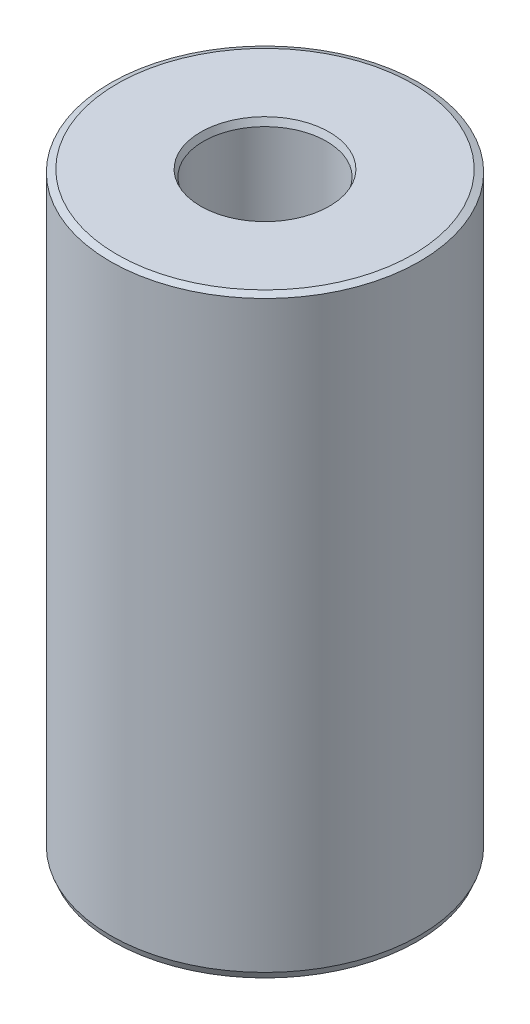
ISO-10303-21;
HEADER;
FILE_DESCRIPTION(('STEP AP214'),'2;1');
FILE_NAME('part.step','',(''),(''),'','','');
FILE_SCHEMA(('AUTOMOTIVE_DESIGN { 1 0 10303 214 1 1 1 1 }'));
ENDSEC;
DATA;
#1=APPLICATION_CONTEXT('core data for automotive mechanical design processes');
#2=APPLICATION_PROTOCOL_DEFINITION('international standard','automotive_design',2000,#1);
#3=PRODUCT_CONTEXT('',#1,'mechanical');
#4=PRODUCT('Part','Part','',(#3));
#5=PRODUCT_RELATED_PRODUCT_CATEGORY('part','',(#4));
#6=PRODUCT_DEFINITION_FORMATION('','',#4);
#7=PRODUCT_DEFINITION_CONTEXT('part definition',#1,'design');
#8=PRODUCT_DEFINITION('design','',#6,#7);
#9=PRODUCT_DEFINITION_SHAPE('','',#8);
#10=(LENGTH_UNIT() NAMED_UNIT(*) SI_UNIT(.MILLI.,.METRE.));
#11=(NAMED_UNIT(*) PLANE_ANGLE_UNIT() SI_UNIT($,.RADIAN.));
#12=(NAMED_UNIT(*) SI_UNIT($,.STERADIAN.) SOLID_ANGLE_UNIT());
#13=UNCERTAINTY_MEASURE_WITH_UNIT(LENGTH_MEASURE(1.E-05),#10,'distance_accuracy_value','');
#14=(GEOMETRIC_REPRESENTATION_CONTEXT(3) GLOBAL_UNCERTAINTY_ASSIGNED_CONTEXT((#13)) GLOBAL_UNIT_ASSIGNED_CONTEXT((#10,
#11,#12)) REPRESENTATION_CONTEXT('',''));
#15=CARTESIAN_POINT('',(0.,0.,0.));
#16=DIRECTION('',(0.,0.,1.));
#17=DIRECTION('',(1.,0.,0.));
#18=AXIS2_PLACEMENT_3D('',#15,#16,#17);
#19=CARTESIAN_POINT('',(0.,95.8740188078757,0.));
#20=DIRECTION('',(0.,-1.,0.));
#21=DIRECTION('',(0.,0.,-1.));
#22=AXIS2_PLACEMENT_3D('',#19,#20,#21);
#23=CYLINDRICAL_SURFACE('',#22,25.);
#24=CARTESIAN_POINT('',(0.,1.08448727969515,0.));
#25=DIRECTION('',(0.,1.,0.));
#26=DIRECTION('',(0.,0.,1.));
#27=AXIS2_PLACEMENT_3D('',#24,#25,#26);
#28=CIRCLE('',#27,25.);
#29=CARTESIAN_POINT('',(0.,1.08448727969515,25.));
#30=VERTEX_POINT('',#29);
#31=EDGE_CURVE('E10',#30,#30,#28,.T.);
#32=ORIENTED_EDGE('',*,*,#31,.T.);
#33=EDGE_LOOP('',(#32));
#34=FACE_BOUND('',#33,.T.);
#35=CARTESIAN_POINT('',(0.,95.4402482773253,0.));
#36=DIRECTION('',(0.,1.,0.));
#37=DIRECTION('',(0.,0.,1.));
#38=AXIS2_PLACEMENT_3D('',#35,#36,#37);
#39=CIRCLE('',#38,25.);
#40=CARTESIAN_POINT('',(0.,95.4402482773253,25.));
#41=VERTEX_POINT('',#40);
#42=EDGE_CURVE('E50',#41,#41,#39,.F.);
#43=ORIENTED_EDGE('',*,*,#42,.T.);
#44=EDGE_LOOP('',(#43));
#45=FACE_BOUND('',#44,.T.);
#46=ADVANCED_FACE('F39',(#34,#45),#23,.T.);
#47=CARTESIAN_POINT('',(0.,95.8740188078757,0.));
#48=DIRECTION('',(0.,1.,0.));
#49=DIRECTION('',(0.,0.,1.));
#50=AXIS2_PLACEMENT_3D('',#47,#48,#49);
#51=PLANE('',#50);
#52=CARTESIAN_POINT('',(0.,95.8740188078757,0.));
#53=DIRECTION('',(0.,1.,0.));
#54=DIRECTION('',(0.,0.,1.));
#55=AXIS2_PLACEMENT_3D('',#52,#53,#54);
#56=CIRCLE('',#55,10.3966789289429);
#57=CARTESIAN_POINT('',(0.,95.8740188078757,10.3966789289429));
#58=VERTEX_POINT('',#57);
#59=EDGE_CURVE('E58',#58,#58,#56,.F.);
#60=ORIENTED_EDGE('',*,*,#59,.T.);
#61=EDGE_LOOP('',(#60));
#62=FACE_BOUND('',#61,.T.);
#63=CARTESIAN_POINT('',(0.,95.8740188078757,0.));
#64=DIRECTION('',(0.,1.,0.));
#65=DIRECTION('',(0.,0.,1.));
#66=AXIS2_PLACEMENT_3D('',#63,#64,#65);
#67=CIRCLE('',#66,23.9155127203048);
#68=CARTESIAN_POINT('',(0.,95.8740188078757,23.9155127203048));
#69=VERTEX_POINT('',#68);
#70=EDGE_CURVE('E61',#69,#69,#67,.T.);
#71=ORIENTED_EDGE('',*,*,#70,.T.);
#72=EDGE_LOOP('',(#71));
#73=FACE_BOUND('',#72,.T.);
#74=ADVANCED_FACE('F88',(#62,#73),#51,.T.);
#75=CARTESIAN_POINT('',(0.,0.,0.));
#76=DIRECTION('',(0.,1.,0.));
#77=DIRECTION('',(0.,0.,1.));
#78=AXIS2_PLACEMENT_3D('',#75,#76,#77);
#79=PLANE('',#78);
#80=CARTESIAN_POINT('',(0.,0.,0.));
#81=DIRECTION('',(0.,1.,0.));
#82=DIRECTION('',(0.,0.,1.));
#83=AXIS2_PLACEMENT_3D('',#80,#81,#82);
#84=CIRCLE('',#83,11.0473956780876);
#85=CARTESIAN_POINT('',(0.,0.,11.0473956780876));
#86=VERTEX_POINT('',#85);
#87=EDGE_CURVE('E51',#86,#86,#84,.T.);
#88=ORIENTED_EDGE('',*,*,#87,.T.);
#89=EDGE_LOOP('',(#88));
#90=FACE_BOUND('',#89,.T.);
#91=CARTESIAN_POINT('',(0.,0.,0.));
#92=DIRECTION('',(0.,1.,0.));
#93=DIRECTION('',(0.,0.,1.));
#94=AXIS2_PLACEMENT_3D('',#91,#92,#93);
#95=CIRCLE('',#94,24.5662294694496);
#96=CARTESIAN_POINT('',(0.,0.,24.5662294694496));
#97=VERTEX_POINT('',#96);
#98=EDGE_CURVE('E54',#97,#97,#95,.F.);
#99=ORIENTED_EDGE('',*,*,#98,.T.);
#100=EDGE_LOOP('',(#99));
#101=FACE_BOUND('',#100,.T.);
#102=ADVANCED_FACE('F83',(#90,#101),#79,.F.);
#103=CARTESIAN_POINT('',(0.,95.8740188078757,0.));
#104=DIRECTION('',(0.,-1.,0.));
#105=DIRECTION('',(0.,0.,-1.));
#106=AXIS2_PLACEMENT_3D('',#103,#104,#105);
#107=CYLINDRICAL_SURFACE('',#106,9.96290839839243);
#108=CARTESIAN_POINT('',(0.,94.7895315281806,0.));
#109=DIRECTION('',(0.,1.,0.));
#110=DIRECTION('',(0.,0.,1.));
#111=AXIS2_PLACEMENT_3D('',#108,#109,#110);
#112=CIRCLE('',#111,9.96290839839243);
#113=CARTESIAN_POINT('',(0.,94.7895315281805,9.96290839839243));
#114=VERTEX_POINT('',#113);
#115=EDGE_CURVE('E67',#114,#114,#112,.T.);
#116=ORIENTED_EDGE('',*,*,#115,.T.);
#117=EDGE_LOOP('',(#116));
#118=FACE_BOUND('',#117,.T.);
#119=CARTESIAN_POINT('',(0.,0.433770530550451,0.));
#120=DIRECTION('',(0.,1.,0.));
#121=DIRECTION('',(0.,0.,1.));
#122=AXIS2_PLACEMENT_3D('',#119,#120,#121);
#123=CIRCLE('',#122,9.96290839839243);
#124=CARTESIAN_POINT('',(0.,0.433770530550451,9.96290839839243));
#125=VERTEX_POINT('',#124);
#126=EDGE_CURVE('E69',#125,#125,#123,.F.);
#127=ORIENTED_EDGE('',*,*,#126,.T.);
#128=EDGE_LOOP('',(#127));
#129=FACE_BOUND('',#128,.T.);
#130=ADVANCED_FACE('F71',(#118,#129),#107,.F.);
#131=CARTESIAN_POINT('',(0.,94.7895315281806,0.));
#132=DIRECTION('',(0.,1.,0.));
#133=DIRECTION('',(0.,0.,1.));
#134=AXIS2_PLACEMENT_3D('',#131,#132,#133);
#135=CONICAL_SURFACE('',#134,9.96290839839243,0.380486996019376);
#136=CARTESIAN_POINT('',(0.,95.8740188078757,10.3966789289429));
#137=CARTESIAN_POINT('',(0.,95.8627220653789,10.3921604859163));
#138=CARTESIAN_POINT('',(0.,95.8514253228821,10.3876420428897));
#139=CARTESIAN_POINT('',(0.,95.8288318378884,10.3786051568366));
#140=CARTESIAN_POINT('',(0.,95.8175350953916,10.37408671381));
#141=CARTESIAN_POINT('',(0.,95.7949416103979,10.3650498277569));
#142=CARTESIAN_POINT('',(0.,95.7836448679011,10.3605313847303));
#143=CARTESIAN_POINT('',(0.,95.7610513829075,10.3514944986772));
#144=CARTESIAN_POINT('',(0.,95.7497546404106,10.3469760556506));
#145=CARTESIAN_POINT('',(0.,95.727161155417,10.3379391695975));
#146=CARTESIAN_POINT('',(0.,95.7158644129202,10.3334207265709));
#147=CARTESIAN_POINT('',(0.,95.6932709279265,10.3243838405178));
#148=CARTESIAN_POINT('',(0.,95.6819741854297,10.3198653974912));
#149=CARTESIAN_POINT('',(0.,95.659380700436,10.3108285114381));
#150=CARTESIAN_POINT('',(0.,95.6480839579392,10.3063100684115));
#151=CARTESIAN_POINT('',(0.,95.6254904729456,10.2972731823584));
#152=CARTESIAN_POINT('',(0.,95.6141937304487,10.2927547393318));
#153=CARTESIAN_POINT('',(0.,95.5916002454551,10.2837178532787));
#154=CARTESIAN_POINT('',(0.,95.5803035029583,10.2791994102521));
#155=CARTESIAN_POINT('',(0.,95.5577100179646,10.270162524199));
#156=CARTESIAN_POINT('',(0.,95.5464132754678,10.2656440811724));
#157=CARTESIAN_POINT('',(0.,95.5238197904741,10.2566071951193));
#158=CARTESIAN_POINT('',(0.,95.5125230479773,10.2520887520927));
#159=CARTESIAN_POINT('',(0.,95.4899295629837,10.2430518660396));
#160=CARTESIAN_POINT('',(0.,95.4786328204868,10.238533423013));
#161=CARTESIAN_POINT('',(0.,95.4560393354932,10.2294965369599));
#162=CARTESIAN_POINT('',(0.,95.4447425929964,10.2249780939333));
#163=CARTESIAN_POINT('',(0.,95.4221491080027,10.2159412078802));
#164=CARTESIAN_POINT('',(0.,95.4108523655059,10.2114227648536));
#165=CARTESIAN_POINT('',(0.,95.3882588805123,10.2023858788005));
#166=CARTESIAN_POINT('',(0.,95.3769621380154,10.1978674357739));
#167=CARTESIAN_POINT('',(0.,95.3543686530218,10.1888305497208));
#168=CARTESIAN_POINT('',(0.,95.343071910525,10.1843121066942));
#169=CARTESIAN_POINT('',(0.,95.3204784255313,10.1752752206411));
#170=CARTESIAN_POINT('',(0.,95.3091816830345,10.1707567776145));
#171=CARTESIAN_POINT('',(0.,95.2865881980408,10.1617198915614));
#172=CARTESIAN_POINT('',(0.,95.275291455544,10.1572014485348));
#173=CARTESIAN_POINT('',(0.,95.2526979705504,10.1481645624817));
#174=CARTESIAN_POINT('',(0.,95.2414012280535,10.1436461194551));
#175=CARTESIAN_POINT('',(0.,95.2188077430599,10.134609233402));
#176=CARTESIAN_POINT('',(0.,95.2075110005631,10.1300907903754));
#177=CARTESIAN_POINT('',(0.,95.1849175155694,10.1210539043223));
#178=CARTESIAN_POINT('',(0.,95.1736207730726,10.1165354612957));
#179=CARTESIAN_POINT('',(0.,95.1510272880789,10.1074985752426));
#180=CARTESIAN_POINT('',(0.,95.1397305455821,10.102980132216));
#181=CARTESIAN_POINT('',(0.,95.1171370605885,10.0939432461629));
#182=CARTESIAN_POINT('',(0.,95.1058403180916,10.0894248031363));
#183=CARTESIAN_POINT('',(0.,95.083246833098,10.0803879170832));
#184=CARTESIAN_POINT('',(0.,95.0719500906012,10.0758694740566));
#185=CARTESIAN_POINT('',(0.,95.0493566056075,10.0668325880035));
#186=CARTESIAN_POINT('',(0.,95.0380598631107,10.0623141449769));
#187=CARTESIAN_POINT('',(0.,95.015466378117,10.0532772589238));
#188=CARTESIAN_POINT('',(0.,95.0041696356202,10.0487588158972));
#189=CARTESIAN_POINT('',(0.,94.9815761506266,10.0397219298441));
#190=CARTESIAN_POINT('',(0.,94.9702794081297,10.0352034868175));
#191=CARTESIAN_POINT('',(0.,94.9476859231361,10.0261666007644));
#192=CARTESIAN_POINT('',(0.,94.9363891806393,10.0216481577378));
#193=CARTESIAN_POINT('',(0.,94.9137956956456,10.0126112716847));
#194=CARTESIAN_POINT('',(0.,94.9024989531488,10.0080928286581));
#195=CARTESIAN_POINT('',(0.,94.8799054681552,9.99905594260496));
#196=CARTESIAN_POINT('',(0.,94.8686087256583,9.9945374995784));
#197=CARTESIAN_POINT('',(0.,94.8460152406647,9.98550061352526));
#198=CARTESIAN_POINT('',(0.,94.8347184981679,9.9809821704987));
#199=CARTESIAN_POINT('',(0.,94.8121250131742,9.97194528444556));
#200=CARTESIAN_POINT('',(0.,94.8008282706774,9.967426841419));
#201=CARTESIAN_POINT('',(0.,94.7895315281806,9.96290839839243));
#202=B_SPLINE_CURVE_WITH_KNOTS('',3,(#136,#137,#138,#139,#140,#141,#142,#143,#144,#145,#146,
#147,#148,#149,#150,#151,#152,#153,#154,#155,#156,#157,#158,#159,#160,#161,#162,#163,#164,#165,
#166,#167,#168,#169,#170,#171,#172,#173,#174,#175,#176,#177,#178,#179,#180,#181,#182,#183,#184,
#185,#186,#187,#188,#189,#190,#191,#192,#193,#194,#195,#196,#197,#198,#199,#200,#201),
.UNSPECIFIED.,.F.,.F.,(4,2,2,2,2,2,2,2,2,2,2,2,2,2,2,2,2,2,2,2,2,2,2,2,2,2,2,2,2,2,2,2,4),(0.,
0.0365006091156771,0.0730012182313541,0.109501827347018,0.146002436462695,0.18250304557836,
0.219003654694037,0.255504263809701,0.292004872925378,0.328505482041043,0.36500609115672,
0.401506700272384,0.438007309388061,0.474507918503725,0.511008527619402,0.547509136735066,
0.584009745850744,0.620510354966421,0.657010964082085,0.693511573197762,0.730012182313426,
0.766512791429103,0.803013400544767,0.839514009660444,0.876014618776109,0.912515227891786,
0.94901583700745,0.985516446123127,1.02201705523879,1.05851766435447,1.09501827347013,
1.13151888258581,1.16801949170147),.UNSPECIFIED.);
#203=EDGE_CURVE('BSEAM77',#58,#114,#202,.T.);
#204=ORIENTED_EDGE('',*,*,#59,.F.);
#205=ORIENTED_EDGE('',*,*,#115,.F.);
#206=ORIENTED_EDGE('',*,*,#203,.T.);
#207=ORIENTED_EDGE('',*,*,#203,.F.);
#208=EDGE_LOOP('',(#204,#206,#205,#207));
#209=FACE_BOUND('',#208,.T.);
#210=ADVANCED_FACE('F77',(#209),#135,.F.);
#211=CARTESIAN_POINT('',(0.,0.,0.));
#212=DIRECTION('',(0.,-1.,0.));
#213=DIRECTION('',(0.,0.,-1.));
#214=AXIS2_PLACEMENT_3D('',#211,#212,#213);
#215=CONICAL_SURFACE('',#214,11.0473956780876,1.19030933077552);
#216=ORIENTED_EDGE('',*,*,#126,.F.);
#217=EDGE_LOOP('',(#216));
#218=FACE_BOUND('',#217,.T.);
#219=ORIENTED_EDGE('',*,*,#87,.F.);
#220=EDGE_LOOP('',(#219));
#221=FACE_BOUND('',#220,.T.);
#222=ADVANCED_FACE('F73',(#218,#221),#215,.F.);
#223=CARTESIAN_POINT('',(0.,1.08448727969515,0.));
#224=DIRECTION('',(0.,1.,0.));
#225=DIRECTION('',(0.,0.,1.));
#226=AXIS2_PLACEMENT_3D('',#223,#224,#225);
#227=CONICAL_SURFACE('',#226,25.,0.380486996019369);
#228=ORIENTED_EDGE('',*,*,#98,.F.);
#229=EDGE_LOOP('',(#228));
#230=FACE_BOUND('',#229,.T.);
#231=ORIENTED_EDGE('',*,*,#31,.F.);
#232=EDGE_LOOP('',(#231));
#233=FACE_BOUND('',#232,.T.);
#234=ADVANCED_FACE('F76',(#230,#233),#227,.T.);
#235=CARTESIAN_POINT('',(0.,95.8740188078757,0.));
#236=DIRECTION('',(0.,-1.,0.));
#237=DIRECTION('',(0.,0.,-1.));
#238=AXIS2_PLACEMENT_3D('',#235,#236,#237);
#239=CONICAL_SURFACE('',#238,23.9155127203048,1.19030933077553);
#240=ORIENTED_EDGE('',*,*,#42,.F.);
#241=EDGE_LOOP('',(#240));
#242=FACE_BOUND('',#241,.T.);
#243=ORIENTED_EDGE('',*,*,#70,.F.);
#244=EDGE_LOOP('',(#243));
#245=FACE_BOUND('',#244,.T.);
#246=ADVANCED_FACE('F45',(#242,#245),#239,.T.);
#247=CLOSED_SHELL('',(#46,#74,#102,#130,#210,#222,#234,#246));
#248=MANIFOLD_SOLID_BREP('B2',#247);
#249=ADVANCED_BREP_SHAPE_REPRESENTATION('',(#18,#248),#14);
#250=SHAPE_DEFINITION_REPRESENTATION(#9,#249);
ENDSEC;
END-ISO-10303-21;
